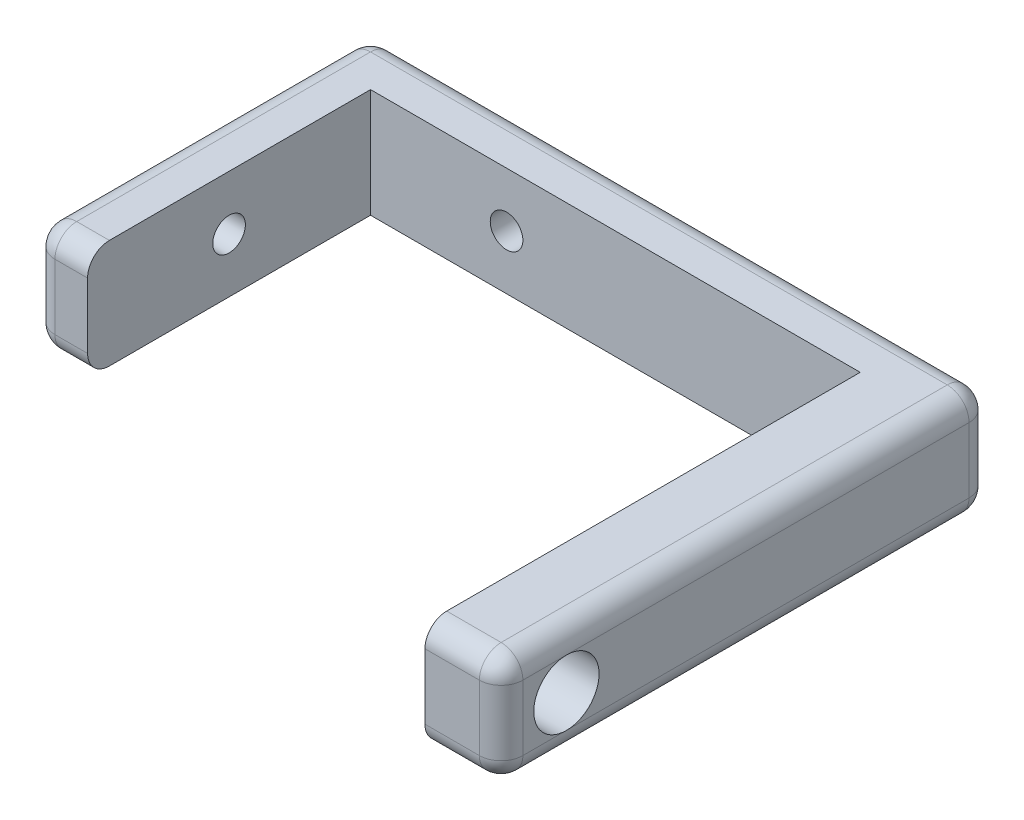
ISO-10303-21;
HEADER;
FILE_DESCRIPTION(('STEP AP214'),'2;1');
FILE_NAME('part.step','',(''),(''),'','','');
FILE_SCHEMA(('AUTOMOTIVE_DESIGN { 1 0 10303 214 1 1 1 1 }'));
ENDSEC;
DATA;
#1=APPLICATION_CONTEXT('core data for automotive mechanical design processes');
#2=APPLICATION_PROTOCOL_DEFINITION('international standard','automotive_design',2000,#1);
#3=PRODUCT_CONTEXT('',#1,'mechanical');
#4=PRODUCT('Part','Part','',(#3));
#5=PRODUCT_RELATED_PRODUCT_CATEGORY('part','',(#4));
#6=PRODUCT_DEFINITION_FORMATION('','',#4);
#7=PRODUCT_DEFINITION_CONTEXT('part definition',#1,'design');
#8=PRODUCT_DEFINITION('design','',#6,#7);
#9=PRODUCT_DEFINITION_SHAPE('','',#8);
#10=(LENGTH_UNIT() NAMED_UNIT(*) SI_UNIT(.MILLI.,.METRE.));
#11=(NAMED_UNIT(*) PLANE_ANGLE_UNIT() SI_UNIT($,.RADIAN.));
#12=(NAMED_UNIT(*) SI_UNIT($,.STERADIAN.) SOLID_ANGLE_UNIT());
#13=UNCERTAINTY_MEASURE_WITH_UNIT(LENGTH_MEASURE(1.E-05),#10,'distance_accuracy_value','');
#14=(GEOMETRIC_REPRESENTATION_CONTEXT(3) GLOBAL_UNCERTAINTY_ASSIGNED_CONTEXT((#13)) GLOBAL_UNIT_ASSIGNED_CONTEXT((#10,
#11,#12)) REPRESENTATION_CONTEXT('',''));
#15=CARTESIAN_POINT('',(0.,0.,0.));
#16=DIRECTION('',(0.,0.,1.));
#17=DIRECTION('',(1.,0.,0.));
#18=AXIS2_PLACEMENT_3D('',#15,#16,#17);
#19=CARTESIAN_POINT('',(39.,10.,0.));
#20=DIRECTION('',(-1.,0.,0.));
#21=DIRECTION('',(0.,0.,1.));
#22=AXIS2_PLACEMENT_3D('',#19,#20,#21);
#23=PLANE('',#22);
#24=CARTESIAN_POINT('',(39.,5.,21.));
#25=DIRECTION('',(1.,0.,0.));
#26=DIRECTION('',(0.,0.,-1.));
#27=AXIS2_PLACEMENT_3D('',#24,#25,#26);
#28=CIRCLE('',#27,3.);
#29=CARTESIAN_POINT('',(39.,2.,21.));
#30=VERTEX_POINT('',#29);
#31=CARTESIAN_POINT('',(39.,8.,21.));
#32=VERTEX_POINT('',#31);
#33=EDGE_CURVE('E346',#30,#32,#28,.T.);
#34=ORIENTED_EDGE('',*,*,#33,.F.);
#35=DIRECTION('',(0.,0.,-1.));
#36=VECTOR('',#35,1.);
#37=CARTESIAN_POINT('',(39.,2.,0.));
#38=LINE('',#37,#36);
#39=CARTESIAN_POINT('',(39.,2.,-16.));
#40=VERTEX_POINT('',#39);
#41=EDGE_CURVE('E251',#30,#40,#38,.T.);
#42=ORIENTED_EDGE('',*,*,#41,.T.);
#43=DIRECTION('',(0.,-1.,0.));
#44=VECTOR('',#43,1.);
#45=CARTESIAN_POINT('',(39.,10.,-16.));
#46=LINE('',#45,#44);
#47=CARTESIAN_POINT('',(39.,8.,-16.));
#48=VERTEX_POINT('',#47);
#49=EDGE_CURVE('E249',#40,#48,#46,.F.);
#50=ORIENTED_EDGE('',*,*,#49,.T.);
#51=DIRECTION('',(0.,0.,-1.));
#52=VECTOR('',#51,1.);
#53=CARTESIAN_POINT('',(39.,8.,27.));
#54=LINE('',#53,#52);
#55=EDGE_CURVE('E244',#48,#32,#54,.F.);
#56=ORIENTED_EDGE('',*,*,#55,.T.);
#57=EDGE_LOOP('',(#34,#42,#50,#56));
#58=FACE_BOUND('',#57,.T.);
#59=ADVANCED_FACE('F35',(#58),#23,.F.);
#60=CARTESIAN_POINT('',(0.,10.,27.));
#61=DIRECTION('',(0.,0.,-1.));
#62=DIRECTION('',(-1.,0.,0.));
#63=AXIS2_PLACEMENT_3D('',#60,#61,#62);
#64=PLANE('',#63);
#65=DIRECTION('',(0.,-1.,0.));
#66=VECTOR('',#65,1.);
#67=CARTESIAN_POINT('',(37.,10.,27.));
#68=LINE('',#67,#66);
#69=CARTESIAN_POINT('',(37.,2.,27.));
#70=VERTEX_POINT('',#69);
#71=CARTESIAN_POINT('',(37.,8.,27.));
#72=VERTEX_POINT('',#71);
#73=EDGE_CURVE('E264',#70,#72,#68,.F.);
#74=ORIENTED_EDGE('',*,*,#73,.T.);
#75=DIRECTION('',(1.,0.,0.));
#76=VECTOR('',#75,1.);
#77=CARTESIAN_POINT('',(32.,8.,27.));
#78=LINE('',#77,#76);
#79=CARTESIAN_POINT('',(32.,8.,27.));
#80=VERTEX_POINT('',#79);
#81=EDGE_CURVE('E266',#72,#80,#78,.F.);
#82=ORIENTED_EDGE('',*,*,#81,.T.);
#83=DIRECTION('',(0.,-1.,0.));
#84=VECTOR('',#83,1.);
#85=CARTESIAN_POINT('',(32.,10.,27.));
#86=LINE('',#85,#84);
#87=CARTESIAN_POINT('',(32.,2.,27.));
#88=VERTEX_POINT('',#87);
#89=EDGE_CURVE('E194',#80,#88,#86,.T.);
#90=ORIENTED_EDGE('',*,*,#89,.T.);
#91=DIRECTION('',(1.,0.,0.));
#92=VECTOR('',#91,1.);
#93=CARTESIAN_POINT('',(0.,2.,27.));
#94=LINE('',#93,#92);
#95=EDGE_CURVE('E262',#88,#70,#94,.T.);
#96=ORIENTED_EDGE('',*,*,#95,.T.);
#97=EDGE_LOOP('',(#74,#82,#90,#96));
#98=FACE_BOUND('',#97,.T.);
#99=ADVANCED_FACE('F452',(#98),#64,.F.);
#100=DIRECTION('',(0.,-1.,0.));
#101=VECTOR('',#100,1.);
#102=CARTESIAN_POINT('',(39.,10.,25.));
#103=LINE('',#102,#101);
#104=CARTESIAN_POINT('',(39.,8.,25.));
#105=VERTEX_POINT('',#104);
#106=CARTESIAN_POINT('',(39.,2.,25.));
#107=VERTEX_POINT('',#106);
#108=EDGE_CURVE('E240',#105,#107,#103,.T.);
#109=ORIENTED_EDGE('',*,*,#108,.T.);
#110=DIRECTION('',(0.,0.,-1.));
#111=VECTOR('',#110,1.);
#112=CARTESIAN_POINT('',(39.,2.,0.));
#113=LINE('',#112,#111);
#114=EDGE_CURVE('E246',#107,#30,#113,.T.);
#115=ORIENTED_EDGE('',*,*,#114,.T.);
#116=EDGE_CURVE('E211',#32,#30,#28,.T.);
#117=ORIENTED_EDGE('',*,*,#116,.F.);
#118=DIRECTION('',(0.,0.,-1.));
#119=VECTOR('',#118,1.);
#120=CARTESIAN_POINT('',(39.,8.,27.));
#121=LINE('',#120,#119);
#122=EDGE_CURVE('E242',#32,#105,#121,.F.);
#123=ORIENTED_EDGE('',*,*,#122,.T.);
#124=EDGE_LOOP('',(#109,#115,#117,#123));
#125=FACE_BOUND('',#124,.T.);
#126=ADVANCED_FACE('F368',(#125),#23,.F.);
#127=CARTESIAN_POINT('',(0.,10.,-18.));
#128=DIRECTION('',(0.,0.,-1.));
#129=DIRECTION('',(-1.,0.,0.));
#130=AXIS2_PLACEMENT_3D('',#127,#128,#129);
#131=PLANE('',#130);
#132=CARTESIAN_POINT('',(-0.500000000000002,5.,-18.));
#133=DIRECTION('',(0.,0.,-1.));
#134=DIRECTION('',(-1.,0.,0.));
#135=AXIS2_PLACEMENT_3D('',#132,#133,#134);
#136=CIRCLE('',#135,1.5);
#137=CARTESIAN_POINT('',(-2.,5.,-18.));
#138=VERTEX_POINT('',#137);
#139=EDGE_CURVE('E348',#138,#138,#136,.T.);
#140=ORIENTED_EDGE('',*,*,#139,.F.);
#141=EDGE_LOOP('',(#140));
#142=FACE_BOUND('',#141,.T.);
#143=DIRECTION('',(1.,0.,0.));
#144=VECTOR('',#143,1.);
#145=CARTESIAN_POINT('',(-18.,2.,-18.));
#146=LINE('',#145,#144);
#147=CARTESIAN_POINT('',(37.,2.,-18.));
#148=VERTEX_POINT('',#147);
#149=CARTESIAN_POINT('',(-16.,2.,-18.));
#150=VERTEX_POINT('',#149);
#151=EDGE_CURVE('E224',#148,#150,#146,.F.);
#152=ORIENTED_EDGE('',*,*,#151,.T.);
#153=DIRECTION('',(0.,-1.,0.));
#154=VECTOR('',#153,1.);
#155=CARTESIAN_POINT('',(-16.,10.,-18.));
#156=LINE('',#155,#154);
#157=CARTESIAN_POINT('',(-16.,8.,-18.));
#158=VERTEX_POINT('',#157);
#159=EDGE_CURVE('E226',#150,#158,#156,.F.);
#160=ORIENTED_EDGE('',*,*,#159,.T.);
#161=DIRECTION('',(1.,0.,0.));
#162=VECTOR('',#161,1.);
#163=CARTESIAN_POINT('',(0.,8.,-18.));
#164=LINE('',#163,#162);
#165=CARTESIAN_POINT('',(37.,8.,-18.));
#166=VERTEX_POINT('',#165);
#167=EDGE_CURVE('E222',#158,#166,#164,.T.);
#168=ORIENTED_EDGE('',*,*,#167,.T.);
#169=DIRECTION('',(0.,-1.,0.));
#170=VECTOR('',#169,1.);
#171=CARTESIAN_POINT('',(37.,0.,-18.));
#172=LINE('',#171,#170);
#173=EDGE_CURVE('E220',#166,#148,#172,.T.);
#174=ORIENTED_EDGE('',*,*,#173,.T.);
#175=EDGE_LOOP('',(#152,#160,#168,#174));
#176=FACE_BOUND('',#175,.T.);
#177=ADVANCED_FACE('F465',(#142,#176),#131,.T.);
#178=CARTESIAN_POINT('',(-18.,10.,0.));
#179=DIRECTION('',(-1.,0.,0.));
#180=DIRECTION('',(0.,0.,1.));
#181=AXIS2_PLACEMENT_3D('',#178,#179,#180);
#182=PLANE('',#181);
#183=CARTESIAN_POINT('',(-18.,5.,0.));
#184=DIRECTION('',(-1.,0.,0.));
#185=DIRECTION('',(0.,0.,1.));
#186=AXIS2_PLACEMENT_3D('',#183,#184,#185);
#187=CIRCLE('',#186,1.5);
#188=CARTESIAN_POINT('',(-18.,5.,1.5));
#189=VERTEX_POINT('',#188);
#190=EDGE_CURVE('E356',#189,#189,#187,.T.);
#191=ORIENTED_EDGE('',*,*,#190,.F.);
#192=EDGE_LOOP('',(#191));
#193=FACE_BOUND('',#192,.T.);
#194=DIRECTION('',(0.,0.,-1.));
#195=VECTOR('',#194,1.);
#196=CARTESIAN_POINT('',(-18.,8.,0.));
#197=LINE('',#196,#195);
#198=CARTESIAN_POINT('',(-18.,8.,11.));
#199=VERTEX_POINT('',#198);
#200=CARTESIAN_POINT('',(-18.,8.,-16.));
#201=VERTEX_POINT('',#200);
#202=EDGE_CURVE('E213',#199,#201,#197,.T.);
#203=ORIENTED_EDGE('',*,*,#202,.T.);
#204=DIRECTION('',(0.,-1.,0.));
#205=VECTOR('',#204,1.);
#206=CARTESIAN_POINT('',(-18.,10.,-16.));
#207=LINE('',#206,#205);
#208=CARTESIAN_POINT('',(-18.,2.,-16.));
#209=VERTEX_POINT('',#208);
#210=EDGE_CURVE('E217',#201,#209,#207,.T.);
#211=ORIENTED_EDGE('',*,*,#210,.T.);
#212=DIRECTION('',(0.,0.,-1.));
#213=VECTOR('',#212,1.);
#214=CARTESIAN_POINT('',(-18.,2.,13.));
#215=LINE('',#214,#213);
#216=CARTESIAN_POINT('',(-18.,2.,11.));
#217=VERTEX_POINT('',#216);
#218=EDGE_CURVE('E215',#209,#217,#215,.F.);
#219=ORIENTED_EDGE('',*,*,#218,.T.);
#220=DIRECTION('',(0.,-1.,0.));
#221=VECTOR('',#220,1.);
#222=CARTESIAN_POINT('',(-18.,10.,11.));
#223=LINE('',#222,#221);
#224=EDGE_CURVE('E208',#217,#199,#223,.F.);
#225=ORIENTED_EDGE('',*,*,#224,.T.);
#226=EDGE_LOOP('',(#203,#211,#219,#225));
#227=FACE_BOUND('',#226,.T.);
#228=ADVANCED_FACE('F473',(#193,#227),#182,.T.);
#229=CARTESIAN_POINT('',(0.,10.,13.));
#230=DIRECTION('',(0.,0.,1.));
#231=DIRECTION('',(1.,0.,0.));
#232=AXIS2_PLACEMENT_3D('',#229,#230,#231);
#233=PLANE('',#232);
#234=DIRECTION('',(0.,-1.,0.));
#235=VECTOR('',#234,1.);
#236=CARTESIAN_POINT('',(-16.,10.,13.));
#237=LINE('',#236,#235);
#238=CARTESIAN_POINT('',(-16.,8.,13.));
#239=VERTEX_POINT('',#238);
#240=CARTESIAN_POINT('',(-16.,2.,13.));
#241=VERTEX_POINT('',#240);
#242=EDGE_CURVE('E52',#239,#241,#237,.T.);
#243=ORIENTED_EDGE('',*,*,#242,.T.);
#244=DIRECTION('',(-1.,0.,0.));
#245=VECTOR('',#244,1.);
#246=CARTESIAN_POINT('',(-13.,2.,13.));
#247=LINE('',#246,#245);
#248=CARTESIAN_POINT('',(-13.,2.,13.));
#249=VERTEX_POINT('',#248);
#250=EDGE_CURVE('E270',#241,#249,#247,.F.);
#251=ORIENTED_EDGE('',*,*,#250,.T.);
#252=DIRECTION('',(0.,-1.,0.));
#253=VECTOR('',#252,1.);
#254=CARTESIAN_POINT('',(-13.,10.,13.));
#255=LINE('',#254,#253);
#256=CARTESIAN_POINT('',(-13.,8.,13.));
#257=VERTEX_POINT('',#256);
#258=EDGE_CURVE('E186',#257,#249,#255,.T.);
#259=ORIENTED_EDGE('',*,*,#258,.F.);
#260=DIRECTION('',(-1.,0.,0.));
#261=VECTOR('',#260,1.);
#262=CARTESIAN_POINT('',(0.,8.,13.));
#263=LINE('',#262,#261);
#264=EDGE_CURVE('E57',#257,#239,#263,.T.);
#265=ORIENTED_EDGE('',*,*,#264,.T.);
#266=EDGE_LOOP('',(#243,#251,#259,#265));
#267=FACE_BOUND('',#266,.T.);
#268=ADVANCED_FACE('F422',(#267),#233,.T.);
#269=CARTESIAN_POINT('',(-13.,10.,0.));
#270=DIRECTION('',(-1.,0.,0.));
#271=DIRECTION('',(0.,0.,1.));
#272=AXIS2_PLACEMENT_3D('',#269,#270,#271);
#273=PLANE('',#272);
#274=CARTESIAN_POINT('',(-13.,5.,0.));
#275=DIRECTION('',(-1.,0.,0.));
#276=DIRECTION('',(0.,0.,1.));
#277=AXIS2_PLACEMENT_3D('',#274,#275,#276);
#278=CIRCLE('',#277,1.5);
#279=CARTESIAN_POINT('',(-13.,5.,1.5));
#280=VERTEX_POINT('',#279);
#281=EDGE_CURVE('E39',#280,#280,#278,.T.);
#282=ORIENTED_EDGE('',*,*,#281,.T.);
#283=EDGE_LOOP('',(#282));
#284=FACE_BOUND('',#283,.T.);
#285=ORIENTED_EDGE('',*,*,#258,.T.);
#286=CARTESIAN_POINT('',(-13.,2.,11.));
#287=DIRECTION('',(-1.,0.,0.));
#288=DIRECTION('',(0.,0.,1.));
#289=AXIS2_PLACEMENT_3D('',#286,#287,#288);
#290=CIRCLE('',#289,2.);
#291=CARTESIAN_POINT('',(-13.,0.,11.));
#292=VERTEX_POINT('',#291);
#293=EDGE_CURVE('E11',#249,#292,#290,.F.);
#294=ORIENTED_EDGE('',*,*,#293,.T.);
#295=DIRECTION('',(0.,0.,-1.));
#296=VECTOR('',#295,1.);
#297=CARTESIAN_POINT('',(-13.,0.,0.));
#298=LINE('',#297,#296);
#299=CARTESIAN_POINT('',(-13.,0.,-13.));
#300=VERTEX_POINT('',#299);
#301=EDGE_CURVE('E183',#292,#300,#298,.T.);
#302=ORIENTED_EDGE('',*,*,#301,.T.);
#303=DIRECTION('',(0.,-1.,0.));
#304=VECTOR('',#303,1.);
#305=CARTESIAN_POINT('',(-13.,10.,-13.));
#306=LINE('',#305,#304);
#307=CARTESIAN_POINT('',(-13.,10.,-13.));
#308=VERTEX_POINT('',#307);
#309=EDGE_CURVE('E179',#308,#300,#306,.T.);
#310=ORIENTED_EDGE('',*,*,#309,.F.);
#311=DIRECTION('',(0.,0.,-1.));
#312=VECTOR('',#311,1.);
#313=CARTESIAN_POINT('',(-13.,10.,0.));
#314=LINE('',#313,#312);
#315=CARTESIAN_POINT('',(-13.,10.,11.));
#316=VERTEX_POINT('',#315);
#317=EDGE_CURVE('E165',#316,#308,#314,.T.);
#318=ORIENTED_EDGE('',*,*,#317,.F.);
#319=CARTESIAN_POINT('',(-13.,8.,11.));
#320=DIRECTION('',(-1.,0.,0.));
#321=DIRECTION('',(0.,0.,1.));
#322=AXIS2_PLACEMENT_3D('',#319,#320,#321);
#323=CIRCLE('',#322,2.);
#324=EDGE_CURVE('E44',#316,#257,#323,.F.);
#325=ORIENTED_EDGE('',*,*,#324,.T.);
#326=EDGE_LOOP('',(#285,#294,#302,#310,#318,#325));
#327=FACE_BOUND('',#326,.T.);
#328=ADVANCED_FACE('F181',(#284,#327),#273,.F.);
#329=CARTESIAN_POINT('',(0.,10.,-13.));
#330=DIRECTION('',(0.,0.,-1.));
#331=DIRECTION('',(-1.,0.,0.));
#332=AXIS2_PLACEMENT_3D('',#329,#330,#331);
#333=PLANE('',#332);
#334=CARTESIAN_POINT('',(-0.500000000000001,5.,-13.));
#335=DIRECTION('',(0.,0.,-1.));
#336=DIRECTION('',(-1.,0.,0.));
#337=AXIS2_PLACEMENT_3D('',#334,#335,#336);
#338=CIRCLE('',#337,1.5);
#339=CARTESIAN_POINT('',(-2.,5.,-13.));
#340=VERTEX_POINT('',#339);
#341=EDGE_CURVE('E280',#340,#340,#338,.T.);
#342=ORIENTED_EDGE('',*,*,#341,.T.);
#343=EDGE_LOOP('',(#342));
#344=FACE_BOUND('',#343,.T.);
#345=DIRECTION('',(1.,0.,0.));
#346=VECTOR('',#345,1.);
#347=CARTESIAN_POINT('',(0.,0.,-13.));
#348=LINE('',#347,#346);
#349=CARTESIAN_POINT('',(32.,0.,-13.));
#350=VERTEX_POINT('',#349);
#351=EDGE_CURVE('E199',#300,#350,#348,.T.);
#352=ORIENTED_EDGE('',*,*,#351,.T.);
#353=DIRECTION('',(0.,-1.,0.));
#354=VECTOR('',#353,1.);
#355=CARTESIAN_POINT('',(32.,10.,-13.));
#356=LINE('',#355,#354);
#357=CARTESIAN_POINT('',(32.,10.,-13.));
#358=VERTEX_POINT('',#357);
#359=EDGE_CURVE('E187',#358,#350,#356,.T.);
#360=ORIENTED_EDGE('',*,*,#359,.F.);
#361=DIRECTION('',(1.,0.,0.));
#362=VECTOR('',#361,1.);
#363=CARTESIAN_POINT('',(0.,10.,-13.));
#364=LINE('',#363,#362);
#365=EDGE_CURVE('E170',#308,#358,#364,.T.);
#366=ORIENTED_EDGE('',*,*,#365,.F.);
#367=ORIENTED_EDGE('',*,*,#309,.T.);
#368=EDGE_LOOP('',(#352,#360,#366,#367));
#369=FACE_BOUND('',#368,.T.);
#370=ADVANCED_FACE('F189',(#344,#369),#333,.F.);
#371=CARTESIAN_POINT('',(32.,10.,0.));
#372=DIRECTION('',(1.,0.,0.));
#373=DIRECTION('',(0.,0.,-1.));
#374=AXIS2_PLACEMENT_3D('',#371,#372,#373);
#375=PLANE('',#374);
#376=CARTESIAN_POINT('',(32.,5.,21.));
#377=DIRECTION('',(1.,0.,0.));
#378=DIRECTION('',(0.,0.,-1.));
#379=AXIS2_PLACEMENT_3D('',#376,#377,#378);
#380=CIRCLE('',#379,3.);
#381=CARTESIAN_POINT('',(32.,5.,18.));
#382=VERTEX_POINT('',#381);
#383=EDGE_CURVE('E200',#382,#382,#380,.T.);
#384=ORIENTED_EDGE('',*,*,#383,.T.);
#385=EDGE_LOOP('',(#384));
#386=FACE_BOUND('',#385,.T.);
#387=ORIENTED_EDGE('',*,*,#89,.F.);
#388=CARTESIAN_POINT('',(32.,8.,25.));
#389=DIRECTION('',(1.,0.,0.));
#390=DIRECTION('',(0.,0.,-1.));
#391=AXIS2_PLACEMENT_3D('',#388,#389,#390);
#392=CIRCLE('',#391,2.);
#393=CARTESIAN_POINT('',(32.,10.,25.));
#394=VERTEX_POINT('',#393);
#395=EDGE_CURVE('E274',#80,#394,#392,.F.);
#396=ORIENTED_EDGE('',*,*,#395,.T.);
#397=DIRECTION('',(0.,0.,1.));
#398=VECTOR('',#397,1.);
#399=CARTESIAN_POINT('',(32.,10.,0.));
#400=LINE('',#399,#398);
#401=EDGE_CURVE('E192',#358,#394,#400,.T.);
#402=ORIENTED_EDGE('',*,*,#401,.F.);
#403=ORIENTED_EDGE('',*,*,#359,.T.);
#404=DIRECTION('',(0.,0.,1.));
#405=VECTOR('',#404,1.);
#406=CARTESIAN_POINT('',(32.,0.,0.));
#407=LINE('',#406,#405);
#408=CARTESIAN_POINT('',(32.,0.,25.));
#409=VERTEX_POINT('',#408);
#410=EDGE_CURVE('E176',#350,#409,#407,.T.);
#411=ORIENTED_EDGE('',*,*,#410,.T.);
#412=CARTESIAN_POINT('',(32.,2.,25.));
#413=DIRECTION('',(1.,0.,0.));
#414=DIRECTION('',(0.,0.,-1.));
#415=AXIS2_PLACEMENT_3D('',#412,#413,#414);
#416=CIRCLE('',#415,2.);
#417=EDGE_CURVE('E272',#409,#88,#416,.F.);
#418=ORIENTED_EDGE('',*,*,#417,.T.);
#419=EDGE_LOOP('',(#387,#396,#402,#403,#411,#418));
#420=FACE_BOUND('',#419,.T.);
#421=ADVANCED_FACE('F445',(#386,#420),#375,.F.);
#422=CARTESIAN_POINT('',(0.,10.,0.));
#423=DIRECTION('',(0.,1.,0.));
#424=DIRECTION('',(0.,0.,1.));
#425=AXIS2_PLACEMENT_3D('',#422,#423,#424);
#426=PLANE('',#425);
#427=ORIENTED_EDGE('',*,*,#401,.T.);
#428=DIRECTION('',(1.,0.,0.));
#429=VECTOR('',#428,1.);
#430=CARTESIAN_POINT('',(39.,10.,25.));
#431=LINE('',#430,#429);
#432=CARTESIAN_POINT('',(37.,10.,25.));
#433=VERTEX_POINT('',#432);
#434=EDGE_CURVE('E260',#394,#433,#431,.T.);
#435=ORIENTED_EDGE('',*,*,#434,.T.);
#436=DIRECTION('',(0.,0.,-1.));
#437=VECTOR('',#436,1.);
#438=CARTESIAN_POINT('',(37.,10.,-18.));
#439=LINE('',#438,#437);
#440=CARTESIAN_POINT('',(37.,10.,-16.));
#441=VERTEX_POINT('',#440);
#442=EDGE_CURVE('E258',#433,#441,#439,.T.);
#443=ORIENTED_EDGE('',*,*,#442,.T.);
#444=DIRECTION('',(1.,0.,0.));
#445=VECTOR('',#444,1.);
#446=CARTESIAN_POINT('',(0.,10.,-16.));
#447=LINE('',#446,#445);
#448=CARTESIAN_POINT('',(-16.,10.,-16.));
#449=VERTEX_POINT('',#448);
#450=EDGE_CURVE('E256',#441,#449,#447,.F.);
#451=ORIENTED_EDGE('',*,*,#450,.T.);
#452=DIRECTION('',(0.,0.,-1.));
#453=VECTOR('',#452,1.);
#454=CARTESIAN_POINT('',(-16.,10.,0.));
#455=LINE('',#454,#453);
#456=CARTESIAN_POINT('',(-16.,10.,11.));
#457=VERTEX_POINT('',#456);
#458=EDGE_CURVE('E254',#449,#457,#455,.F.);
#459=ORIENTED_EDGE('',*,*,#458,.T.);
#460=DIRECTION('',(-1.,0.,0.));
#461=VECTOR('',#460,1.);
#462=CARTESIAN_POINT('',(0.,10.,11.));
#463=LINE('',#462,#461);
#464=EDGE_CURVE('E173',#457,#316,#463,.F.);
#465=ORIENTED_EDGE('',*,*,#464,.T.);
#466=ORIENTED_EDGE('',*,*,#317,.T.);
#467=ORIENTED_EDGE('',*,*,#365,.T.);
#468=EDGE_LOOP('',(#427,#435,#443,#451,#459,#465,#466,#467));
#469=FACE_BOUND('',#468,.T.);
#470=ADVANCED_FACE('F168',(#469),#426,.T.);
#471=CARTESIAN_POINT('',(0.,0.,0.));
#472=DIRECTION('',(0.,1.,0.));
#473=DIRECTION('',(0.,0.,1.));
#474=AXIS2_PLACEMENT_3D('',#471,#472,#473);
#475=PLANE('',#474);
#476=DIRECTION('',(0.,0.,-1.));
#477=VECTOR('',#476,1.);
#478=CARTESIAN_POINT('',(37.,0.,0.));
#479=LINE('',#478,#477);
#480=CARTESIAN_POINT('',(37.,0.,-16.));
#481=VERTEX_POINT('',#480);
#482=CARTESIAN_POINT('',(37.,0.,25.));
#483=VERTEX_POINT('',#482);
#484=EDGE_CURVE('E236',#481,#483,#479,.F.);
#485=ORIENTED_EDGE('',*,*,#484,.T.);
#486=DIRECTION('',(1.,0.,0.));
#487=VECTOR('',#486,1.);
#488=CARTESIAN_POINT('',(0.,0.,25.));
#489=LINE('',#488,#487);
#490=EDGE_CURVE('E238',#483,#409,#489,.F.);
#491=ORIENTED_EDGE('',*,*,#490,.T.);
#492=ORIENTED_EDGE('',*,*,#410,.F.);
#493=ORIENTED_EDGE('',*,*,#351,.F.);
#494=ORIENTED_EDGE('',*,*,#301,.F.);
#495=DIRECTION('',(-1.,0.,0.));
#496=VECTOR('',#495,1.);
#497=CARTESIAN_POINT('',(-18.,0.,11.));
#498=LINE('',#497,#496);
#499=CARTESIAN_POINT('',(-16.,0.,11.));
#500=VERTEX_POINT('',#499);
#501=EDGE_CURVE('E229',#292,#500,#498,.T.);
#502=ORIENTED_EDGE('',*,*,#501,.T.);
#503=DIRECTION('',(0.,0.,-1.));
#504=VECTOR('',#503,1.);
#505=CARTESIAN_POINT('',(-16.,0.,-18.));
#506=LINE('',#505,#504);
#507=CARTESIAN_POINT('',(-16.,0.,-16.));
#508=VERTEX_POINT('',#507);
#509=EDGE_CURVE('E231',#500,#508,#506,.T.);
#510=ORIENTED_EDGE('',*,*,#509,.T.);
#511=DIRECTION('',(1.,0.,0.));
#512=VECTOR('',#511,1.);
#513=CARTESIAN_POINT('',(39.,0.,-16.));
#514=LINE('',#513,#512);
#515=EDGE_CURVE('E234',#508,#481,#514,.T.);
#516=ORIENTED_EDGE('',*,*,#515,.T.);
#517=EDGE_LOOP('',(#485,#491,#492,#493,#494,#502,#510,#516));
#518=FACE_BOUND('',#517,.T.);
#519=ADVANCED_FACE('F441',(#518),#475,.F.);
#520=CARTESIAN_POINT('',(29.,5.,21.));
#521=DIRECTION('',(1.,0.,0.));
#522=DIRECTION('',(0.,0.,-1.));
#523=AXIS2_PLACEMENT_3D('',#520,#521,#522);
#524=CYLINDRICAL_SURFACE('',#523,3.);
#525=ORIENTED_EDGE('',*,*,#116,.T.);
#526=ORIENTED_EDGE('',*,*,#33,.T.);
#527=EDGE_LOOP('',(#525,#526));
#528=FACE_BOUND('',#527,.T.);
#529=ORIENTED_EDGE('',*,*,#383,.F.);
#530=EDGE_LOOP('',(#529));
#531=FACE_BOUND('',#530,.T.);
#532=ADVANCED_FACE('F363',(#528,#531),#524,.F.);
#533=CARTESIAN_POINT('',(0.,8.,25.));
#534=DIRECTION('',(-1.,0.,0.));
#535=DIRECTION('',(0.,0.,1.));
#536=AXIS2_PLACEMENT_3D('',#533,#534,#535);
#537=CYLINDRICAL_SURFACE('',#536,2.);
#538=ORIENTED_EDGE('',*,*,#395,.F.);
#539=ORIENTED_EDGE('',*,*,#81,.F.);
#540=CARTESIAN_POINT('',(37.,8.,25.));
#541=DIRECTION('',(1.,0.,0.));
#542=DIRECTION('',(0.,0.,-1.));
#543=AXIS2_PLACEMENT_3D('',#540,#541,#542);
#544=CIRCLE('',#543,2.);
#545=EDGE_CURVE('E341',#433,#72,#544,.T.);
#546=ORIENTED_EDGE('',*,*,#545,.F.);
#547=ORIENTED_EDGE('',*,*,#434,.F.);
#548=EDGE_LOOP('',(#538,#539,#546,#547));
#549=FACE_BOUND('',#548,.T.);
#550=ADVANCED_FACE('F37',(#549),#537,.T.);
#551=CARTESIAN_POINT('',(0.,2.,25.));
#552=DIRECTION('',(1.,0.,0.));
#553=DIRECTION('',(0.,0.,-1.));
#554=AXIS2_PLACEMENT_3D('',#551,#552,#553);
#555=CYLINDRICAL_SURFACE('',#554,2.);
#556=ORIENTED_EDGE('',*,*,#417,.F.);
#557=ORIENTED_EDGE('',*,*,#490,.F.);
#558=CARTESIAN_POINT('',(37.,2.,25.));
#559=DIRECTION('',(1.,0.,0.));
#560=DIRECTION('',(0.,0.,-1.));
#561=AXIS2_PLACEMENT_3D('',#558,#559,#560);
#562=CIRCLE('',#561,2.);
#563=EDGE_CURVE('E338',#70,#483,#562,.T.);
#564=ORIENTED_EDGE('',*,*,#563,.F.);
#565=ORIENTED_EDGE('',*,*,#95,.F.);
#566=EDGE_LOOP('',(#556,#557,#564,#565));
#567=FACE_BOUND('',#566,.T.);
#568=ADVANCED_FACE('F456',(#567),#555,.T.);
#569=CARTESIAN_POINT('',(37.,10.,25.));
#570=DIRECTION('',(0.,-1.,0.));
#571=DIRECTION('',(0.,0.,-1.));
#572=AXIS2_PLACEMENT_3D('',#569,#570,#571);
#573=CYLINDRICAL_SURFACE('',#572,2.);
#574=CARTESIAN_POINT('',(37.,8.,25.));
#575=DIRECTION('',(0.,1.,0.));
#576=DIRECTION('',(0.,0.,1.));
#577=AXIS2_PLACEMENT_3D('',#574,#575,#576);
#578=CIRCLE('',#577,2.);
#579=EDGE_CURVE('E344',#72,#105,#578,.T.);
#580=ORIENTED_EDGE('',*,*,#579,.F.);
#581=ORIENTED_EDGE('',*,*,#73,.F.);
#582=CARTESIAN_POINT('',(37.,2.,25.));
#583=DIRECTION('',(0.,-1.,0.));
#584=DIRECTION('',(0.,0.,-1.));
#585=AXIS2_PLACEMENT_3D('',#582,#583,#584);
#586=CIRCLE('',#585,2.);
#587=EDGE_CURVE('E335',#107,#70,#586,.T.);
#588=ORIENTED_EDGE('',*,*,#587,.F.);
#589=ORIENTED_EDGE('',*,*,#108,.F.);
#590=EDGE_LOOP('',(#580,#581,#588,#589));
#591=FACE_BOUND('',#590,.T.);
#592=ADVANCED_FACE('F384',(#591),#573,.T.);
#593=CARTESIAN_POINT('',(37.,8.,25.));
#594=DIRECTION('',(0.,0.,1.));
#595=DIRECTION('',(1.,0.,0.));
#596=AXIS2_PLACEMENT_3D('',#593,#594,#595);
#597=SPHERICAL_SURFACE('',#596,2.);
#598=ORIENTED_EDGE('',*,*,#545,.T.);
#599=ORIENTED_EDGE('',*,*,#579,.T.);
#600=CARTESIAN_POINT('',(37.,8.,25.));
#601=DIRECTION('',(0.,0.,1.));
#602=DIRECTION('',(1.,0.,0.));
#603=AXIS2_PLACEMENT_3D('',#600,#601,#602);
#604=CIRCLE('',#603,2.);
#605=EDGE_CURVE('E332',#433,#105,#604,.F.);
#606=ORIENTED_EDGE('',*,*,#605,.F.);
#607=EDGE_LOOP('',(#598,#599,#606));
#608=FACE_BOUND('',#607,.T.);
#609=ADVANCED_FACE('F379',(#608),#597,.T.);
#610=CARTESIAN_POINT('',(37.,2.,25.));
#611=DIRECTION('',(0.,0.,1.));
#612=DIRECTION('',(1.,0.,0.));
#613=AXIS2_PLACEMENT_3D('',#610,#611,#612);
#614=SPHERICAL_SURFACE('',#613,2.);
#615=ORIENTED_EDGE('',*,*,#587,.T.);
#616=ORIENTED_EDGE('',*,*,#563,.T.);
#617=CARTESIAN_POINT('',(37.,2.,25.));
#618=DIRECTION('',(0.,0.,1.));
#619=DIRECTION('',(1.,0.,0.));
#620=AXIS2_PLACEMENT_3D('',#617,#618,#619);
#621=CIRCLE('',#620,2.);
#622=EDGE_CURVE('E329',#107,#483,#621,.F.);
#623=ORIENTED_EDGE('',*,*,#622,.F.);
#624=EDGE_LOOP('',(#615,#616,#623));
#625=FACE_BOUND('',#624,.T.);
#626=ADVANCED_FACE('F389',(#625),#614,.T.);
#627=CARTESIAN_POINT('',(37.,8.,0.));
#628=DIRECTION('',(0.,0.,1.));
#629=DIRECTION('',(1.,0.,0.));
#630=AXIS2_PLACEMENT_3D('',#627,#628,#629);
#631=CYLINDRICAL_SURFACE('',#630,2.);
#632=ORIENTED_EDGE('',*,*,#122,.F.);
#633=ORIENTED_EDGE('',*,*,#55,.F.);
#634=CARTESIAN_POINT('',(37.,8.,-16.));
#635=DIRECTION('',(0.,0.,-1.));
#636=DIRECTION('',(-1.,0.,0.));
#637=AXIS2_PLACEMENT_3D('',#634,#635,#636);
#638=CIRCLE('',#637,2.);
#639=EDGE_CURVE('E323',#441,#48,#638,.T.);
#640=ORIENTED_EDGE('',*,*,#639,.F.);
#641=ORIENTED_EDGE('',*,*,#442,.F.);
#642=ORIENTED_EDGE('',*,*,#605,.T.);
#643=EDGE_LOOP('',(#632,#633,#640,#641,#642));
#644=FACE_BOUND('',#643,.T.);
#645=ADVANCED_FACE('F373',(#644),#631,.T.);
#646=CARTESIAN_POINT('',(0.,8.,11.));
#647=DIRECTION('',(-1.,0.,0.));
#648=DIRECTION('',(0.,0.,1.));
#649=AXIS2_PLACEMENT_3D('',#646,#647,#648);
#650=CYLINDRICAL_SURFACE('',#649,2.);
#651=ORIENTED_EDGE('',*,*,#324,.F.);
#652=ORIENTED_EDGE('',*,*,#464,.F.);
#653=CARTESIAN_POINT('',(-16.,8.,11.));
#654=DIRECTION('',(-1.,0.,0.));
#655=DIRECTION('',(0.,0.,1.));
#656=AXIS2_PLACEMENT_3D('',#653,#654,#655);
#657=CIRCLE('',#656,2.);
#658=EDGE_CURVE('E320',#239,#457,#657,.T.);
#659=ORIENTED_EDGE('',*,*,#658,.F.);
#660=ORIENTED_EDGE('',*,*,#264,.F.);
#661=EDGE_LOOP('',(#651,#652,#659,#660));
#662=FACE_BOUND('',#661,.T.);
#663=ADVANCED_FACE('F420',(#662),#650,.T.);
#664=CARTESIAN_POINT('',(-16.,10.,11.));
#665=DIRECTION('',(0.,-1.,0.));
#666=DIRECTION('',(0.,0.,-1.));
#667=AXIS2_PLACEMENT_3D('',#664,#665,#666);
#668=CYLINDRICAL_SURFACE('',#667,2.);
#669=CARTESIAN_POINT('',(-16.,2.,11.));
#670=DIRECTION('',(0.,-1.,0.));
#671=DIRECTION('',(0.,0.,-1.));
#672=AXIS2_PLACEMENT_3D('',#669,#670,#671);
#673=CIRCLE('',#672,2.);
#674=EDGE_CURVE('E314',#241,#217,#673,.T.);
#675=ORIENTED_EDGE('',*,*,#674,.F.);
#676=ORIENTED_EDGE('',*,*,#242,.F.);
#677=CARTESIAN_POINT('',(-16.,8.,11.));
#678=DIRECTION('',(0.,1.,0.));
#679=DIRECTION('',(0.,0.,1.));
#680=AXIS2_PLACEMENT_3D('',#677,#678,#679);
#681=CIRCLE('',#680,2.);
#682=EDGE_CURVE('E317',#199,#239,#681,.T.);
#683=ORIENTED_EDGE('',*,*,#682,.F.);
#684=ORIENTED_EDGE('',*,*,#224,.F.);
#685=EDGE_LOOP('',(#675,#676,#683,#684));
#686=FACE_BOUND('',#685,.T.);
#687=ADVANCED_FACE('F431',(#686),#668,.T.);
#688=CARTESIAN_POINT('',(0.,2.,11.));
#689=DIRECTION('',(1.,0.,0.));
#690=DIRECTION('',(0.,0.,-1.));
#691=AXIS2_PLACEMENT_3D('',#688,#689,#690);
#692=CYLINDRICAL_SURFACE('',#691,2.);
#693=ORIENTED_EDGE('',*,*,#293,.F.);
#694=ORIENTED_EDGE('',*,*,#250,.F.);
#695=CARTESIAN_POINT('',(-16.,2.,11.));
#696=DIRECTION('',(-1.,0.,0.));
#697=DIRECTION('',(0.,0.,1.));
#698=AXIS2_PLACEMENT_3D('',#695,#696,#697);
#699=CIRCLE('',#698,2.);
#700=EDGE_CURVE('E311',#500,#241,#699,.T.);
#701=ORIENTED_EDGE('',*,*,#700,.F.);
#702=ORIENTED_EDGE('',*,*,#501,.F.);
#703=EDGE_LOOP('',(#693,#694,#701,#702));
#704=FACE_BOUND('',#703,.T.);
#705=ADVANCED_FACE('F426',(#704),#692,.T.);
#706=CARTESIAN_POINT('',(37.,2.,0.));
#707=DIRECTION('',(0.,0.,-1.));
#708=DIRECTION('',(-1.,0.,0.));
#709=AXIS2_PLACEMENT_3D('',#706,#707,#708);
#710=CYLINDRICAL_SURFACE('',#709,2.);
#711=ORIENTED_EDGE('',*,*,#622,.T.);
#712=ORIENTED_EDGE('',*,*,#484,.F.);
#713=CARTESIAN_POINT('',(37.,2.,-16.));
#714=DIRECTION('',(0.,0.,-1.));
#715=DIRECTION('',(-1.,0.,0.));
#716=AXIS2_PLACEMENT_3D('',#713,#714,#715);
#717=CIRCLE('',#716,2.);
#718=EDGE_CURVE('E308',#40,#481,#717,.T.);
#719=ORIENTED_EDGE('',*,*,#718,.F.);
#720=ORIENTED_EDGE('',*,*,#41,.F.);
#721=ORIENTED_EDGE('',*,*,#114,.F.);
#722=EDGE_LOOP('',(#711,#712,#719,#720,#721));
#723=FACE_BOUND('',#722,.T.);
#724=ADVANCED_FACE('F392',(#723),#710,.T.);
#725=CARTESIAN_POINT('',(37.,10.,-16.));
#726=DIRECTION('',(0.,1.,0.));
#727=DIRECTION('',(0.,0.,1.));
#728=AXIS2_PLACEMENT_3D('',#725,#726,#727);
#729=CYLINDRICAL_SURFACE('',#728,2.);
#730=CARTESIAN_POINT('',(37.,8.,-16.));
#731=DIRECTION('',(0.,1.,0.));
#732=DIRECTION('',(0.,0.,1.));
#733=AXIS2_PLACEMENT_3D('',#730,#731,#732);
#734=CIRCLE('',#733,2.);
#735=EDGE_CURVE('E326',#48,#166,#734,.T.);
#736=ORIENTED_EDGE('',*,*,#735,.F.);
#737=ORIENTED_EDGE('',*,*,#49,.F.);
#738=CARTESIAN_POINT('',(37.,2.,-16.));
#739=DIRECTION('',(0.,-1.,0.));
#740=DIRECTION('',(0.,0.,-1.));
#741=AXIS2_PLACEMENT_3D('',#738,#739,#740);
#742=CIRCLE('',#741,2.);
#743=EDGE_CURVE('E305',#148,#40,#742,.T.);
#744=ORIENTED_EDGE('',*,*,#743,.F.);
#745=ORIENTED_EDGE('',*,*,#173,.F.);
#746=EDGE_LOOP('',(#736,#737,#744,#745));
#747=FACE_BOUND('',#746,.T.);
#748=ADVANCED_FACE('F397',(#747),#729,.T.);
#749=CARTESIAN_POINT('',(37.,8.,-16.));
#750=DIRECTION('',(0.,0.,1.));
#751=DIRECTION('',(1.,0.,0.));
#752=AXIS2_PLACEMENT_3D('',#749,#750,#751);
#753=SPHERICAL_SURFACE('',#752,2.);
#754=ORIENTED_EDGE('',*,*,#639,.T.);
#755=ORIENTED_EDGE('',*,*,#735,.T.);
#756=CARTESIAN_POINT('',(37.,8.,-16.));
#757=DIRECTION('',(1.,0.,0.));
#758=DIRECTION('',(0.,0.,-1.));
#759=AXIS2_PLACEMENT_3D('',#756,#757,#758);
#760=CIRCLE('',#759,2.);
#761=EDGE_CURVE('E302',#441,#166,#760,.F.);
#762=ORIENTED_EDGE('',*,*,#761,.F.);
#763=EDGE_LOOP('',(#754,#755,#762));
#764=FACE_BOUND('',#763,.T.);
#765=ADVANCED_FACE('F402',(#764),#753,.T.);
#766=CARTESIAN_POINT('',(-16.,8.,11.));
#767=DIRECTION('',(0.,0.,1.));
#768=DIRECTION('',(1.,0.,0.));
#769=AXIS2_PLACEMENT_3D('',#766,#767,#768);
#770=SPHERICAL_SURFACE('',#769,2.);
#771=ORIENTED_EDGE('',*,*,#682,.T.);
#772=ORIENTED_EDGE('',*,*,#658,.T.);
#773=CARTESIAN_POINT('',(-16.,8.,11.));
#774=DIRECTION('',(0.,0.,1.));
#775=DIRECTION('',(1.,0.,0.));
#776=AXIS2_PLACEMENT_3D('',#773,#774,#775);
#777=CIRCLE('',#776,2.);
#778=EDGE_CURVE('E299',#199,#457,#777,.F.);
#779=ORIENTED_EDGE('',*,*,#778,.F.);
#780=EDGE_LOOP('',(#771,#772,#779));
#781=FACE_BOUND('',#780,.T.);
#782=ADVANCED_FACE('F416',(#781),#770,.T.);
#783=CARTESIAN_POINT('',(-16.,2.,11.));
#784=DIRECTION('',(0.,0.,1.));
#785=DIRECTION('',(1.,0.,0.));
#786=AXIS2_PLACEMENT_3D('',#783,#784,#785);
#787=SPHERICAL_SURFACE('',#786,2.);
#788=ORIENTED_EDGE('',*,*,#700,.T.);
#789=ORIENTED_EDGE('',*,*,#674,.T.);
#790=CARTESIAN_POINT('',(-16.,2.,11.));
#791=DIRECTION('',(0.,0.,1.));
#792=DIRECTION('',(1.,0.,0.));
#793=AXIS2_PLACEMENT_3D('',#790,#791,#792);
#794=CIRCLE('',#793,2.);
#795=EDGE_CURVE('E296',#500,#217,#794,.F.);
#796=ORIENTED_EDGE('',*,*,#795,.F.);
#797=EDGE_LOOP('',(#788,#789,#796));
#798=FACE_BOUND('',#797,.T.);
#799=ADVANCED_FACE('F433',(#798),#787,.T.);
#800=CARTESIAN_POINT('',(37.,2.,-16.));
#801=DIRECTION('',(0.,0.,1.));
#802=DIRECTION('',(1.,0.,0.));
#803=AXIS2_PLACEMENT_3D('',#800,#801,#802);
#804=SPHERICAL_SURFACE('',#803,2.);
#805=ORIENTED_EDGE('',*,*,#743,.T.);
#806=ORIENTED_EDGE('',*,*,#718,.T.);
#807=CARTESIAN_POINT('',(37.,2.,-16.));
#808=DIRECTION('',(1.,0.,0.));
#809=DIRECTION('',(0.,0.,-1.));
#810=AXIS2_PLACEMENT_3D('',#807,#808,#809);
#811=CIRCLE('',#810,2.);
#812=EDGE_CURVE('E293',#148,#481,#811,.F.);
#813=ORIENTED_EDGE('',*,*,#812,.F.);
#814=EDGE_LOOP('',(#805,#806,#813));
#815=FACE_BOUND('',#814,.T.);
#816=ADVANCED_FACE('F458',(#815),#804,.T.);
#817=CARTESIAN_POINT('',(0.,8.,-16.));
#818=DIRECTION('',(1.,0.,0.));
#819=DIRECTION('',(0.,0.,-1.));
#820=AXIS2_PLACEMENT_3D('',#817,#818,#819);
#821=CYLINDRICAL_SURFACE('',#820,2.);
#822=ORIENTED_EDGE('',*,*,#761,.T.);
#823=ORIENTED_EDGE('',*,*,#167,.F.);
#824=CARTESIAN_POINT('',(-16.,8.,-16.));
#825=DIRECTION('',(-1.,0.,0.));
#826=DIRECTION('',(0.,0.,1.));
#827=AXIS2_PLACEMENT_3D('',#824,#825,#826);
#828=CIRCLE('',#827,2.);
#829=EDGE_CURVE('E290',#449,#158,#828,.T.);
#830=ORIENTED_EDGE('',*,*,#829,.F.);
#831=ORIENTED_EDGE('',*,*,#450,.F.);
#832=EDGE_LOOP('',(#822,#823,#830,#831));
#833=FACE_BOUND('',#832,.T.);
#834=ADVANCED_FACE('F407',(#833),#821,.T.);
#835=CARTESIAN_POINT('',(-16.,8.,0.));
#836=DIRECTION('',(0.,0.,-1.));
#837=DIRECTION('',(-1.,0.,0.));
#838=AXIS2_PLACEMENT_3D('',#835,#836,#837);
#839=CYLINDRICAL_SURFACE('',#838,2.);
#840=ORIENTED_EDGE('',*,*,#778,.T.);
#841=ORIENTED_EDGE('',*,*,#458,.F.);
#842=CARTESIAN_POINT('',(-16.,8.,-16.));
#843=DIRECTION('',(0.,0.,-1.));
#844=DIRECTION('',(-1.,0.,0.));
#845=AXIS2_PLACEMENT_3D('',#842,#843,#844);
#846=CIRCLE('',#845,2.);
#847=EDGE_CURVE('E287',#201,#449,#846,.T.);
#848=ORIENTED_EDGE('',*,*,#847,.F.);
#849=ORIENTED_EDGE('',*,*,#202,.F.);
#850=EDGE_LOOP('',(#840,#841,#848,#849));
#851=FACE_BOUND('',#850,.T.);
#852=ADVANCED_FACE('F411',(#851),#839,.T.);
#853=CARTESIAN_POINT('',(-16.,2.,0.));
#854=DIRECTION('',(0.,0.,1.));
#855=DIRECTION('',(1.,0.,0.));
#856=AXIS2_PLACEMENT_3D('',#853,#854,#855);
#857=CYLINDRICAL_SURFACE('',#856,2.);
#858=ORIENTED_EDGE('',*,*,#795,.T.);
#859=ORIENTED_EDGE('',*,*,#218,.F.);
#860=CARTESIAN_POINT('',(-16.,2.,-16.));
#861=DIRECTION('',(0.,0.,-1.));
#862=DIRECTION('',(-1.,0.,0.));
#863=AXIS2_PLACEMENT_3D('',#860,#861,#862);
#864=CIRCLE('',#863,2.);
#865=EDGE_CURVE('E284',#508,#209,#864,.T.);
#866=ORIENTED_EDGE('',*,*,#865,.F.);
#867=ORIENTED_EDGE('',*,*,#509,.F.);
#868=EDGE_LOOP('',(#858,#859,#866,#867));
#869=FACE_BOUND('',#868,.T.);
#870=ADVANCED_FACE('F438',(#869),#857,.T.);
#871=CARTESIAN_POINT('',(0.,2.,-16.));
#872=DIRECTION('',(-1.,0.,0.));
#873=DIRECTION('',(0.,0.,1.));
#874=AXIS2_PLACEMENT_3D('',#871,#872,#873);
#875=CYLINDRICAL_SURFACE('',#874,2.);
#876=ORIENTED_EDGE('',*,*,#812,.T.);
#877=ORIENTED_EDGE('',*,*,#515,.F.);
#878=CARTESIAN_POINT('',(-16.,2.,-16.));
#879=DIRECTION('',(-1.,0.,0.));
#880=DIRECTION('',(0.,0.,1.));
#881=AXIS2_PLACEMENT_3D('',#878,#879,#880);
#882=CIRCLE('',#881,2.);
#883=EDGE_CURVE('E282',#150,#508,#882,.T.);
#884=ORIENTED_EDGE('',*,*,#883,.F.);
#885=ORIENTED_EDGE('',*,*,#151,.F.);
#886=EDGE_LOOP('',(#876,#877,#884,#885));
#887=FACE_BOUND('',#886,.T.);
#888=ADVANCED_FACE('F461',(#887),#875,.T.);
#889=CARTESIAN_POINT('',(-16.,8.,-16.));
#890=DIRECTION('',(0.,0.,1.));
#891=DIRECTION('',(1.,0.,0.));
#892=AXIS2_PLACEMENT_3D('',#889,#890,#891);
#893=SPHERICAL_SURFACE('',#892,2.);
#894=ORIENTED_EDGE('',*,*,#847,.T.);
#895=ORIENTED_EDGE('',*,*,#829,.T.);
#896=CARTESIAN_POINT('',(-16.,8.,-16.));
#897=DIRECTION('',(0.,1.,0.));
#898=DIRECTION('',(0.,0.,1.));
#899=AXIS2_PLACEMENT_3D('',#896,#897,#898);
#900=CIRCLE('',#899,2.);
#901=EDGE_CURVE('E279',#201,#158,#900,.F.);
#902=ORIENTED_EDGE('',*,*,#901,.F.);
#903=EDGE_LOOP('',(#894,#895,#902));
#904=FACE_BOUND('',#903,.T.);
#905=ADVANCED_FACE('F690',(#904),#893,.T.);
#906=CARTESIAN_POINT('',(-16.,2.,-16.));
#907=DIRECTION('',(0.,0.,1.));
#908=DIRECTION('',(1.,0.,0.));
#909=AXIS2_PLACEMENT_3D('',#906,#907,#908);
#910=SPHERICAL_SURFACE('',#909,2.);
#911=ORIENTED_EDGE('',*,*,#883,.T.);
#912=ORIENTED_EDGE('',*,*,#865,.T.);
#913=CARTESIAN_POINT('',(-16.,2.,-16.));
#914=DIRECTION('',(0.,-1.,0.));
#915=DIRECTION('',(0.,0.,-1.));
#916=AXIS2_PLACEMENT_3D('',#913,#914,#915);
#917=CIRCLE('',#916,2.);
#918=EDGE_CURVE('E277',#150,#209,#917,.F.);
#919=ORIENTED_EDGE('',*,*,#918,.F.);
#920=EDGE_LOOP('',(#911,#912,#919));
#921=FACE_BOUND('',#920,.T.);
#922=ADVANCED_FACE('F471',(#921),#910,.T.);
#923=CARTESIAN_POINT('',(-16.,10.,-16.));
#924=DIRECTION('',(0.,-1.,0.));
#925=DIRECTION('',(0.,0.,-1.));
#926=AXIS2_PLACEMENT_3D('',#923,#924,#925);
#927=CYLINDRICAL_SURFACE('',#926,2.);
#928=ORIENTED_EDGE('',*,*,#901,.T.);
#929=ORIENTED_EDGE('',*,*,#159,.F.);
#930=ORIENTED_EDGE('',*,*,#918,.T.);
#931=ORIENTED_EDGE('',*,*,#210,.F.);
#932=EDGE_LOOP('',(#928,#929,#930,#931));
#933=FACE_BOUND('',#932,.T.);
#934=ADVANCED_FACE('F468',(#933),#927,.T.);
#935=CARTESIAN_POINT('',(-0.500000000000001,5.,-8.));
#936=DIRECTION('',(0.,0.,-1.));
#937=DIRECTION('',(-1.,0.,0.));
#938=AXIS2_PLACEMENT_3D('',#935,#936,#937);
#939=CYLINDRICAL_SURFACE('',#938,1.5);
#940=ORIENTED_EDGE('',*,*,#139,.T.);
#941=EDGE_LOOP('',(#940));
#942=FACE_BOUND('',#941,.T.);
#943=ORIENTED_EDGE('',*,*,#341,.F.);
#944=EDGE_LOOP('',(#943));
#945=FACE_BOUND('',#944,.T.);
#946=ADVANCED_FACE('F524',(#942,#945),#939,.F.);
#947=CARTESIAN_POINT('',(-8.,5.,0.));
#948=DIRECTION('',(-1.,0.,0.));
#949=DIRECTION('',(0.,0.,1.));
#950=AXIS2_PLACEMENT_3D('',#947,#948,#949);
#951=CYLINDRICAL_SURFACE('',#950,1.5);
#952=ORIENTED_EDGE('',*,*,#190,.T.);
#953=EDGE_LOOP('',(#952));
#954=FACE_BOUND('',#953,.T.);
#955=ORIENTED_EDGE('',*,*,#281,.F.);
#956=EDGE_LOOP('',(#955));
#957=FACE_BOUND('',#956,.T.);
#958=ADVANCED_FACE('F528',(#954,#957),#951,.F.);
#959=CLOSED_SHELL('',(#59,#99,#126,#177,#228,#268,#328,#370,#421,#470,#519,#532,#550,#568,#592,
#609,#626,#645,#663,#687,#705,#724,#748,#765,#782,#799,#816,#834,#852,#870,#888,#905,#922,#934,
#946,#958));
#960=MANIFOLD_SOLID_BREP('B2',#959);
#961=ADVANCED_BREP_SHAPE_REPRESENTATION('',(#18,#960),#14);
#962=SHAPE_DEFINITION_REPRESENTATION(#9,#961);
ENDSEC;
END-ISO-10303-21;
